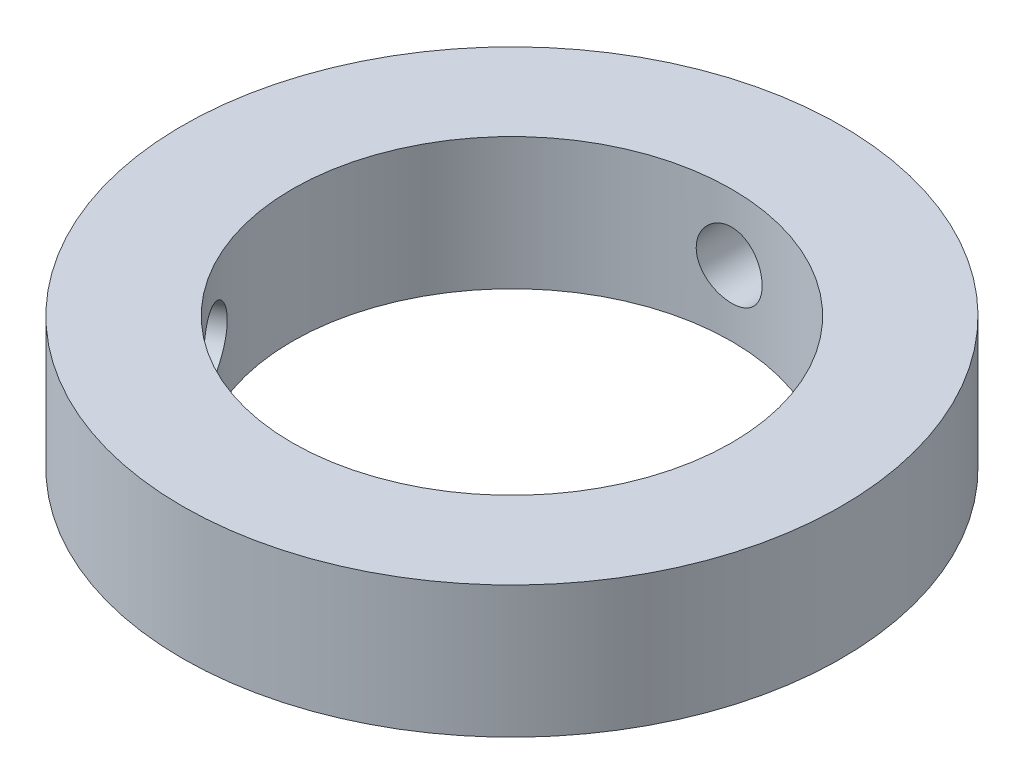
ISO-10303-21;
HEADER;
FILE_DESCRIPTION(('STEP AP214'),'2;1');
FILE_NAME('part.step','',(''),(''),'','','');
FILE_SCHEMA(('AUTOMOTIVE_DESIGN { 1 0 10303 214 1 1 1 1 }'));
ENDSEC;
DATA;
#1=APPLICATION_CONTEXT('core data for automotive mechanical design processes');
#2=APPLICATION_PROTOCOL_DEFINITION('international standard','automotive_design',2000,#1);
#3=PRODUCT_CONTEXT('',#1,'mechanical');
#4=PRODUCT('Part','Part','',(#3));
#5=PRODUCT_RELATED_PRODUCT_CATEGORY('part','',(#4));
#6=PRODUCT_DEFINITION_FORMATION('','',#4);
#7=PRODUCT_DEFINITION_CONTEXT('part definition',#1,'design');
#8=PRODUCT_DEFINITION('design','',#6,#7);
#9=PRODUCT_DEFINITION_SHAPE('','',#8);
#10=(LENGTH_UNIT() NAMED_UNIT(*) SI_UNIT(.MILLI.,.METRE.));
#11=(NAMED_UNIT(*) PLANE_ANGLE_UNIT() SI_UNIT($,.RADIAN.));
#12=(NAMED_UNIT(*) SI_UNIT($,.STERADIAN.) SOLID_ANGLE_UNIT());
#13=UNCERTAINTY_MEASURE_WITH_UNIT(LENGTH_MEASURE(1.E-05),#10,'distance_accuracy_value','');
#14=(GEOMETRIC_REPRESENTATION_CONTEXT(3) GLOBAL_UNCERTAINTY_ASSIGNED_CONTEXT((#13)) GLOBAL_UNIT_ASSIGNED_CONTEXT((#10,
#11,#12)) REPRESENTATION_CONTEXT('',''));
#15=CARTESIAN_POINT('',(0.,0.,0.));
#16=DIRECTION('',(0.,0.,1.));
#17=DIRECTION('',(1.,0.,0.));
#18=AXIS2_PLACEMENT_3D('',#15,#16,#17);
#19=CARTESIAN_POINT('',(0.,6.,0.));
#20=DIRECTION('',(0.,1.,0.));
#21=DIRECTION('',(0.,0.,1.));
#22=AXIS2_PLACEMENT_3D('',#19,#20,#21);
#23=PLANE('',#22);
#24=CARTESIAN_POINT('',(0.,6.,0.));
#25=DIRECTION('',(0.,1.,0.));
#26=DIRECTION('',(0.,0.,1.));
#27=AXIS2_PLACEMENT_3D('',#24,#25,#26);
#28=CIRCLE('',#27,15.);
#29=CARTESIAN_POINT('',(0.,6.,15.));
#30=VERTEX_POINT('',#29);
#31=EDGE_CURVE('E10',#30,#30,#28,.T.);
#32=ORIENTED_EDGE('',*,*,#31,.T.);
#33=EDGE_LOOP('',(#32));
#34=FACE_BOUND('',#33,.T.);
#35=CARTESIAN_POINT('',(0.,6.,0.));
#36=DIRECTION('',(0.,1.,0.));
#37=DIRECTION('',(0.,0.,1.));
#38=AXIS2_PLACEMENT_3D('',#35,#36,#37);
#39=CIRCLE('',#38,10.);
#40=CARTESIAN_POINT('',(0.,6.,10.));
#41=VERTEX_POINT('',#40);
#42=EDGE_CURVE('E42',#41,#41,#39,.T.);
#43=ORIENTED_EDGE('',*,*,#42,.F.);
#44=EDGE_LOOP('',(#43));
#45=FACE_BOUND('',#44,.T.);
#46=ADVANCED_FACE('F31',(#34,#45),#23,.T.);
#47=CARTESIAN_POINT('',(0.,0.,0.));
#48=DIRECTION('',(0.,1.,0.));
#49=DIRECTION('',(0.,0.,1.));
#50=AXIS2_PLACEMENT_3D('',#47,#48,#49);
#51=PLANE('',#50);
#52=CARTESIAN_POINT('',(0.,0.,0.));
#53=DIRECTION('',(0.,1.,0.));
#54=DIRECTION('',(0.,0.,1.));
#55=AXIS2_PLACEMENT_3D('',#52,#53,#54);
#56=CIRCLE('',#55,15.);
#57=CARTESIAN_POINT('',(0.,0.,15.));
#58=VERTEX_POINT('',#57);
#59=EDGE_CURVE('E35',#58,#58,#56,.T.);
#60=ORIENTED_EDGE('',*,*,#59,.F.);
#61=EDGE_LOOP('',(#60));
#62=FACE_BOUND('',#61,.T.);
#63=CARTESIAN_POINT('',(0.,0.,0.));
#64=DIRECTION('',(0.,1.,0.));
#65=DIRECTION('',(0.,0.,1.));
#66=AXIS2_PLACEMENT_3D('',#63,#64,#65);
#67=CIRCLE('',#66,10.);
#68=CARTESIAN_POINT('',(0.,0.,10.));
#69=VERTEX_POINT('',#68);
#70=EDGE_CURVE('E44',#69,#69,#67,.T.);
#71=ORIENTED_EDGE('',*,*,#70,.T.);
#72=EDGE_LOOP('',(#71));
#73=FACE_BOUND('',#72,.T.);
#74=ADVANCED_FACE('F94',(#62,#73),#51,.F.);
#75=CARTESIAN_POINT('',(0.,6.,0.));
#76=DIRECTION('',(0.,-1.,0.));
#77=DIRECTION('',(0.,0.,-1.));
#78=AXIS2_PLACEMENT_3D('',#75,#76,#77);
#79=CYLINDRICAL_SURFACE('',#78,15.);
#80=CARTESIAN_POINT('',(-12.1752659547106,3.,8.76144388397628));
#81=CARTESIAN_POINT('',(-12.1752686280073,3.0840293462604,8.76144122439911));
#82=CARTESIAN_POINT('',(-12.1794295090357,3.16811425261776,8.75566699297302));
#83=CARTESIAN_POINT('',(-12.195913927037,3.3339527794403,8.73269006037868));
#84=CARTESIAN_POINT('',(-12.2082464595789,3.41570372705624,8.71547476452298));
#85=CARTESIAN_POINT('',(-12.2405589633176,3.57444872882686,8.67003395391286));
#86=CARTESIAN_POINT('',(-12.2605342981873,3.65144563408716,8.64181511400248));
#87=CARTESIAN_POINT('',(-12.307324045506,3.79855168843763,8.57504686512413));
#88=CARTESIAN_POINT('',(-12.334137099599,3.86866220172558,8.53649950790416));
#89=CARTESIAN_POINT('',(-12.3936583700528,4.00027689548625,8.44985181271415));
#90=CARTESIAN_POINT('',(-12.4263853681295,4.06175251425568,8.40172098812725));
#91=CARTESIAN_POINT('',(-12.496447051945,4.17410641350536,8.29715394900857));
#92=CARTESIAN_POINT('',(-12.533781948382,4.22498420910947,8.24071735466918));
#93=CARTESIAN_POINT('',(-12.6117954593156,4.31479688551073,8.12082098446708));
#94=CARTESIAN_POINT('',(-12.652480921437,4.3537064981905,8.05734672911471));
#95=CARTESIAN_POINT('',(-12.7357203069752,4.41831664972303,7.9251198636053));
#96=CARTESIAN_POINT('',(-12.7782741848199,4.44401751055421,7.85636738215799));
#97=CARTESIAN_POINT('',(-12.8637112282032,4.48139686402988,7.71567757598853));
#98=CARTESIAN_POINT('',(-12.9065928039217,4.49312224912492,7.64375174628928));
#99=CARTESIAN_POINT('',(-12.9915157638989,4.50236290370058,7.49850609755596));
#100=CARTESIAN_POINT('',(-13.0335571699136,4.49987854161941,7.42518631471422));
#101=CARTESIAN_POINT('',(-13.1154686416279,4.48080829102477,7.27952208695975));
#102=CARTESIAN_POINT('',(-13.1553459298286,4.46427282665417,7.2071750929438));
#103=CARTESIAN_POINT('',(-13.2320820705779,4.41764830658007,7.06530344178578));
#104=CARTESIAN_POINT('',(-13.2689408839103,4.38755907481865,6.99577882131799));
#105=CARTESIAN_POINT('',(-13.3388726674995,4.31462585511834,6.86150294871651));
#106=CARTESIAN_POINT('',(-13.3719388734042,4.27175955370477,6.79676029653133));
#107=CARTESIAN_POINT('',(-13.4335588666886,4.17450521499545,6.67414505201013));
#108=CARTESIAN_POINT('',(-13.4621125216821,4.12011683978223,6.6162726612417));
#109=CARTESIAN_POINT('',(-13.5143312366497,4.00107865572953,6.50895047184306));
#110=CARTESIAN_POINT('',(-13.5379743565742,3.93638498288764,6.45953864003969));
#111=CARTESIAN_POINT('',(-13.5798559484302,3.79872470218384,6.37102173569905));
#112=CARTESIAN_POINT('',(-13.598094412522,3.72575808232179,6.33191667811231));
#113=CARTESIAN_POINT('',(-13.6289246329048,3.57358946220032,6.26528276870627));
#114=CARTESIAN_POINT('',(-13.6415151986067,3.49438615136567,6.23775635776673));
#115=CARTESIAN_POINT('',(-13.6608883219285,3.33200909307797,6.19521440602366));
#116=CARTESIAN_POINT('',(-13.6676710564938,3.24883546666883,6.18019848406723));
#117=CARTESIAN_POINT('',(-13.6753334089643,3.08126373070574,6.16322514105224));
#118=CARTESIAN_POINT('',(-13.676238421192,2.99687246960275,6.16121154449792));
#119=CARTESIAN_POINT('',(-13.6722026478534,2.8289231012657,6.17016190318325));
#120=CARTESIAN_POINT('',(-13.6672619412756,2.74536498278945,6.18112568307007));
#121=CARTESIAN_POINT('',(-13.6516080148652,2.58163262658249,6.21562164591093));
#122=CARTESIAN_POINT('',(-13.640906954067,2.50145164335801,6.23912735427677));
#123=CARTESIAN_POINT('',(-13.6138675551842,2.34653992240454,6.29790843807133));
#124=CARTESIAN_POINT('',(-13.5975290879693,2.27180930956922,6.33318408310158));
#125=CARTESIAN_POINT('',(-13.5593599683941,2.12964003895683,6.41449714729722));
#126=CARTESIAN_POINT('',(-13.5375107974431,2.06222708705062,6.46057081525648));
#127=CARTESIAN_POINT('',(-13.4886633299504,1.9368674200889,6.5619447650902));
#128=CARTESIAN_POINT('',(-13.461664905913,1.87892093948988,6.61724527541769));
#129=CARTESIAN_POINT('',(-13.4028565662955,1.77392754990286,6.73556289609712));
#130=CARTESIAN_POINT('',(-13.3710296668994,1.72692066062067,6.79860708908372));
#131=CARTESIAN_POINT('',(-13.3032430047234,1.64541619724038,6.93031047358269));
#132=CARTESIAN_POINT('',(-13.267283298581,1.61091845173934,6.99896958814241));
#133=CARTESIAN_POINT('',(-13.1920843958636,1.55547934851699,7.13969588104783));
#134=CARTESIAN_POINT('',(-13.1528511889519,1.53451381901218,7.21175673451208));
#135=CARTESIAN_POINT('',(-13.0720189272504,1.50665539563023,7.35725789890982));
#136=CARTESIAN_POINT('',(-13.0304199389853,1.49976210624894,7.43069817101583));
#137=CARTESIAN_POINT('',(-12.946182802766,1.50024939965991,7.57650377093299));
#138=CARTESIAN_POINT('',(-12.9035499787105,1.50756785525498,7.64887239016927));
#139=CARTESIAN_POINT('',(-12.8183363511877,1.53614061848546,7.7908349785635));
#140=CARTESIAN_POINT('',(-12.7757555477614,1.55739493705945,7.86042894554351));
#141=CARTESIAN_POINT('',(-12.6920055400196,1.6132188860894,7.99495326915927));
#142=CARTESIAN_POINT('',(-12.6508361440025,1.64778670040123,8.05988426045633));
#143=CARTESIAN_POINT('',(-12.5712857902903,1.72924975337547,8.18340866723737));
#144=CARTESIAN_POINT('',(-12.5329048162809,1.77614491990668,8.24200211980145));
#145=CARTESIAN_POINT('',(-12.4601293337544,1.88116442853562,8.35161846512974));
#146=CARTESIAN_POINT('',(-12.4257522129968,1.9393350243672,8.40260858864906));
#147=CARTESIAN_POINT('',(-12.3624389609383,2.06516302731817,8.49548533727556));
#148=CARTESIAN_POINT('',(-12.333504137358,2.13282270775361,8.53736977476826));
#149=CARTESIAN_POINT('',(-12.2821386285056,2.27589651287987,8.61110337214203));
#150=CARTESIAN_POINT('',(-12.2597246725362,2.35132992198608,8.64292673812074));
#151=CARTESIAN_POINT('',(-12.2224231966915,2.50762243686935,8.69559787459574));
#152=CARTESIAN_POINT('',(-12.2075271880073,2.58847530588857,8.71645802519363));
#153=CARTESIAN_POINT('',(-12.1895865403145,2.72482161134867,8.74151701506189));
#154=CARTESIAN_POINT('',(-12.1842263230693,2.77944337695964,8.74898091559667));
#155=CARTESIAN_POINT('',(-12.1770651576448,2.88936873456383,8.75894521521235));
#156=CARTESIAN_POINT('',(-12.1752641945244,2.94467232369389,8.76144563512908));
#157=CARTESIAN_POINT('',(-12.1752659547106,3.,8.76144388397628));
#158=B_SPLINE_CURVE_WITH_KNOTS('',3,(#80,#81,#82,#83,#84,#85,#86,#87,#88,#89,#90,#91,#92,#93,
#94,#95,#96,#97,#98,#99,#100,#101,#102,#103,#104,#105,#106,#107,#108,#109,#110,#111,#112,#113,
#114,#115,#116,#117,#118,#119,#120,#121,#122,#123,#124,#125,#126,#127,#128,#129,#130,#131,#132,
#133,#134,#135,#136,#137,#138,#139,#140,#141,#142,#143,#144,#145,#146,#147,#148,#149,#150,#151,
#152,#153,#154,#155,#156,#157),.UNSPECIFIED.,.T.,.F.,(4,2,2,2,2,2,2,2,2,2,2,2,2,2,2,2,2,2,2,2,2,
2,2,2,2,2,2,2,2,2,2,2,2,2,2,2,2,2,4),(0.,0.251885991654694,0.504049727732656,0.756060736496213,
1.00802172063197,1.26079742294888,1.5135846878288,1.76690204956938,2.02021323611693,
2.27267206347675,2.52512434497349,2.77667447727993,3.02822787721462,3.28022318199621,
3.53222587827794,3.78533137627503,4.03843724141345,4.29159643676902,4.54474791892551,
4.79680494461649,5.04885856450307,5.30038222056792,5.55191163841573,5.80429784717579,
6.05669030584806,6.30999205227179,6.56329032777009,6.81613489041544,7.06897234669726,
7.32070700202727,7.5724418549499,7.82414237992872,8.07584143216201,8.32859572556985,
8.5814106755179,8.83486861605717,9.08803972341004,9.25389041409072,9.41974040855725),.UNSPECIFIED.);
#159=CARTESIAN_POINT('',(-12.1752659547106,3.,8.76144388397628));
#160=VERTEX_POINT('',#159);
#161=EDGE_CURVE('E76',#160,#160,#158,.T.);
#162=ORIENTED_EDGE('',*,*,#161,.F.);
#163=EDGE_LOOP('',(#162));
#164=FACE_BOUND('',#163,.T.);
#165=CARTESIAN_POINT('',(-1.5,3.,-14.9248115565993));
#166=CARTESIAN_POINT('',(-1.49999636009027,3.0840293462604,-14.9248125419535));
#167=CARTESIAN_POINT('',(-1.49291528847371,3.16811425261776,-14.9255288549133));
#168=CARTESIAN_POINT('',(-1.46477447214534,3.3339527794403,-14.9283163133718));
#169=CARTESIAN_POINT('',(-1.44369932232965,3.41570372705623,-14.9303889519183));
#170=CARTESIAN_POINT('',(-1.38819017410339,3.57444872882686,-14.9356519957108));
#171=CARTESIAN_POINT('',(-1.35376427444085,3.65144563408716,-14.9388417232018));
#172=CARTESIAN_POINT('',(-1.27254640108665,3.79855168843762,-14.9459787085773));
#173=CARTESIAN_POINT('',(-1.22575688343889,3.86866220172558,-14.9499258159649));
#174=CARTESIAN_POINT('',(-1.12095714299806,4.00027689548625,-14.9581489006485));
#175=CARTESIAN_POINT('',(-1.06291112716239,4.06175251425567,-14.962425900079));
#176=CARTESIAN_POINT('',(-0.937322572979346,4.17410641350535,-14.9708175785358));
#177=CARTESIAN_POINT('',(-0.869779600359852,4.22498420910947,-14.9749322501282));
#178=CARTESIAN_POINT('',(-0.72693954247648,4.31479688551073,-14.9825457473341));
#179=CARTESIAN_POINT('',(-0.651626493794353,4.3537064981905,-14.9860432634197));
#180=CARTESIAN_POINT('',(-0.495494976431265,4.41831664972302,-14.9920172531366));
#181=CARTESIAN_POINT('',(-0.414676642002328,4.4440175105542,-14.994493751656));
#182=CARTESIAN_POINT('',(-0.250117174114424,4.48139686402987,-14.9981394985654));
#183=CARTESIAN_POINT('',(-0.166386790547372,4.49312224912492,-14.9993131176423));
#184=CARTESIAN_POINT('',(0.00186111103341518,4.50236290370058,-15.0002357339804));
#185=CARTESIAN_POINT('',(0.0863786085816924,4.49987854161941,-14.9999847681791));
#186=CARTESIAN_POINT('',(0.253483266096841,4.48080829102477,-14.9980900696678));
#187=CARTESIAN_POINT('',(0.336076244902469,4.46427282665416,-14.9964513172757));
#188=CARTESIAN_POINT('',(0.4973087692568,4.41764830658007,-14.991970938974));
#189=CARTESIAN_POINT('',(0.575948263436593,4.38755907481864,-14.9891292974393));
#190=CARTESIAN_POINT('',(0.72720047201938,4.31462585511834,-14.9825540622587));
#191=CARTESIAN_POINT('',(0.799802356472475,4.27175955370476,-14.9788189104864));
#192=CARTESIAN_POINT('',(0.936800269761291,4.17450521499545,-14.9708757677911));
#193=CARTESIAN_POINT('',(1.00119605784124,4.12011683978223,-14.9666677630022));
#194=CARTESIAN_POINT('',(1.12024915773403,4.00107865572953,-14.9582294020178));
#195=CARTESIAN_POINT('',(1.17486261928552,3.93638498288764,-14.9539990285954));
#196=CARTESIAN_POINT('',(1.27246130303688,3.79872470218383,-14.9460110989233));
#197=CARTESIAN_POINT('',(1.31544650836933,3.72575808232179,-14.9422535433595));
#198=CARTESIAN_POINT('',(1.38856827685985,3.57358946220031,-14.9356363427122));
#199=CARTESIAN_POINT('',(1.41870213085944,3.49438615136567,-14.9327768869883));
#200=CARTESIAN_POINT('',(1.46523110345638,3.33200909307797,-14.9282835280641));
#201=CARTESIAN_POINT('',(1.48162664061455,3.24883546666883,-14.9266495875265));
#202=CARTESIAN_POINT('',(1.50015716308794,3.08126373070574,-14.9247987079113));
#203=CARTESIAN_POINT('',(1.50235349497082,2.99687246960275,-14.924575673214));
#204=CARTESIAN_POINT('',(1.49258437030704,2.82892310126571,-14.9255557703216));
#205=CARTESIAN_POINT('',(1.48061910511463,2.74536498278945,-14.9267588828559));
#206=CARTESIAN_POINT('',(1.44291776176128,2.58163262658249,-14.930450166336));
#207=CARTESIAN_POINT('',(1.41721069078336,2.50145164335801,-14.9329356300202));
#208=CARTESIAN_POINT('',(1.35278507951391,2.34653992240454,-14.9389093655819));
#209=CARTESIAN_POINT('',(1.31406624117538,2.27180930956923,-14.94239766043));
#210=CARTESIAN_POINT('',(1.22456250213483,2.12964003895684,-14.9499987653357));
#211=CARTESIAN_POINT('',(1.17373694976104,2.06222708705062,-14.9541136622201));
#212=CARTESIAN_POINT('',(1.06152080017676,1.9368674200889,-14.9624974893778));
#213=CARTESIAN_POINT('',(1.0001299413722,1.87892093948989,-14.966766423463));
#214=CARTESIAN_POINT('',(0.868259706339711,1.77392754990286,-14.9749957177395));
#215=CARTESIAN_POINT('',(0.797748383954178,1.72692066062067,-14.9789549108321));
#216=CARTESIAN_POINT('',(0.649796576125697,1.64541619724038,-14.9861016315995));
#217=CARTESIAN_POINT('',(0.572356185644438,1.61091845173934,-14.9892891698474));
#218=CARTESIAN_POINT('',(0.412884189649223,1.555479348517,-14.9945281562101));
#219=CARTESIAN_POINT('',(0.33086105647494,1.53451381901218,-14.9965816290847));
#220=CARTESIAN_POINT('',(0.164437220975519,1.50665539563023,-14.9993294192047));
#221=CARTESIAN_POINT('',(0.080036585538327,1.49976210624894,-15.0000237746484));
#222=CARTESIAN_POINT('',(-0.0883533361136192,1.50024939965991,-14.999975074699));
#223=CARTESIAN_POINT('',(-0.172342810836791,1.50756785525499,-14.99923827565));
#224=CARTESIAN_POINT('',(-0.337892832534544,1.53614061848546,-14.9964224036639));
#225=CARTESIAN_POINT('',(-0.419453377602548,1.55739493705945,-14.9943433296731));
#226=CARTESIAN_POINT('',(-0.577829863151615,1.6132188860894,-14.9890758572094));
#227=CARTESIAN_POINT('',(-0.654646449116293,1.64778670040124,-14.9858876100487));
#228=CARTESIAN_POINT('',(-0.801396900232194,1.72924975337547,-14.9787571862444));
#229=CARTESIAN_POINT('',(-0.871330805652838,1.77614491990668,-14.9748150140123));
#230=CARTESIAN_POINT('',(-1.00264908664041,1.88116442853563,-14.9665977700358));
#231=CARTESIAN_POINT('',(-1.06399638932901,1.9393350243672,-14.9623213719105));
#232=CARTESIAN_POINT('',(-1.17608663908971,2.06516302731817,-14.9539288615449));
#233=CARTESIAN_POINT('',(-1.22682703777177,2.13282270775362,-14.9498127880167));
#234=CARTESIAN_POINT('',(-1.31636496063608,2.27589651287987,-14.942195751159));
#235=CARTESIAN_POINT('',(-1.35513178199225,2.35132992198608,-14.9386963788796));
#236=CARTESIAN_POINT('',(-1.41939706214815,2.50762243686935,-14.9327279214369));
#237=CARTESIAN_POINT('',(-1.44491048683479,2.58847530588857,-14.9302576748004));
#238=CARTESIAN_POINT('',(-1.47558253250029,2.72482161134867,-14.9272501130722));
#239=CARTESIAN_POINT('',(-1.48472656859734,2.77944337695964,-14.9263399790354));
#240=CARTESIAN_POINT('',(-1.49693648790767,2.88936873456383,-14.9251203776649));
#241=CARTESIAN_POINT('',(-1.5000023966359,2.94467232369389,-14.9248109078098));
#242=CARTESIAN_POINT('',(-1.5,3.,-14.9248115565993));
#243=B_SPLINE_CURVE_WITH_KNOTS('',3,(#165,#166,#167,#168,#169,#170,#171,#172,#173,#174,#175,
#176,#177,#178,#179,#180,#181,#182,#183,#184,#185,#186,#187,#188,#189,#190,#191,#192,#193,#194,
#195,#196,#197,#198,#199,#200,#201,#202,#203,#204,#205,#206,#207,#208,#209,#210,#211,#212,#213,
#214,#215,#216,#217,#218,#219,#220,#221,#222,#223,#224,#225,#226,#227,#228,#229,#230,#231,#232,
#233,#234,#235,#236,#237,#238,#239,#240,#241,#242),.UNSPECIFIED.,.T.,.F.,(4,2,2,2,2,2,2,2,2,2,2,
2,2,2,2,2,2,2,2,2,2,2,2,2,2,2,2,2,2,2,2,2,2,2,2,2,2,2,4),(0.,0.251885991654692,
0.504049727732655,0.756060736496211,1.00802172063197,1.26079742294888,1.51358468782879,
1.76690204956938,2.02021323611692,2.27267206347674,2.52512434497349,2.77667447727992,
3.02822787721461,3.2802231819962,3.53222587827793,3.78533137627502,4.03843724141344,
4.291596436769,4.54474791892549,4.79680494461648,5.04885856450305,5.30038222056791,
5.55191163841571,5.80429784717577,6.05669030584804,6.30999205227177,6.56329032777007,
6.81613489041542,7.06897234669724,7.32070700202724,7.57244185494987,7.82414237992869,
8.07584143216198,8.32859572556982,8.58141067551787,8.83486861605715,9.08803972341001,
9.2538904140907,9.41974040855723),.UNSPECIFIED.);
#244=CARTESIAN_POINT('',(-1.5,3.,-14.9248115565993));
#245=VERTEX_POINT('',#244);
#246=EDGE_CURVE('E56',#245,#245,#243,.T.);
#247=ORIENTED_EDGE('',*,*,#246,.F.);
#248=EDGE_LOOP('',(#247));
#249=FACE_BOUND('',#248,.T.);
#250=ORIENTED_EDGE('',*,*,#31,.F.);
#251=EDGE_LOOP('',(#250));
#252=FACE_BOUND('',#251,.T.);
#253=ORIENTED_EDGE('',*,*,#59,.T.);
#254=EDGE_LOOP('',(#253));
#255=FACE_BOUND('',#254,.T.);
#256=ADVANCED_FACE('F33',(#164,#249,#252,#255),#79,.T.);
#257=CARTESIAN_POINT('',(0.,6.,0.));
#258=DIRECTION('',(0.,-1.,0.));
#259=DIRECTION('',(0.,0.,-1.));
#260=AXIS2_PLACEMENT_3D('',#257,#258,#259);
#261=CYLINDRICAL_SURFACE('',#260,10.);
#262=CARTESIAN_POINT('',(-7.81227189477187,3.,6.24246808899794));
#263=CARTESIAN_POINT('',(-7.81227483670854,3.08374556928995,6.24246579350082));
#264=CARTESIAN_POINT('',(-7.8167218671006,3.16753975075071,6.23691161232913));
#265=CARTESIAN_POINT('',(-7.83431030002112,3.33278531488313,6.21480281416805));
#266=CARTESIAN_POINT('',(-7.84746018292153,3.41423433148001,6.19823746743476));
#267=CARTESIAN_POINT('',(-7.8818230173325,3.5723737554469,6.15448085743884));
#268=CARTESIAN_POINT('',(-7.90302978059303,3.64906776254216,6.12729774891369));
#269=CARTESIAN_POINT('',(-7.95254263433635,3.79562703077208,6.06289599023471));
#270=CARTESIAN_POINT('',(-7.98084774742056,3.8654932302143,6.02567872166933));
#271=CARTESIAN_POINT('',(-8.04356690468586,3.99698381675433,5.94169923196536));
#272=CARTESIAN_POINT('',(-8.07802323609122,4.05854561340674,5.89487057952921));
#273=CARTESIAN_POINT('',(-8.15148642122049,4.1711374856555,5.79285872461926));
#274=CARTESIAN_POINT('',(-8.19049352496962,4.22216698216699,5.73767506306101));
#275=CARTESIAN_POINT('',(-8.27173053418005,4.31247663169136,5.61992939684502));
#276=CARTESIAN_POINT('',(-8.31397502474992,4.35169915032246,5.55733321298581));
#277=CARTESIAN_POINT('',(-8.3999432138492,4.41691159880818,5.42651570784787));
#278=CARTESIAN_POINT('',(-8.44366683409039,4.4429022278429,5.35829468401009));
#279=CARTESIAN_POINT('',(-8.53073492500932,4.48072338853084,5.21855197993721));
#280=CARTESIAN_POINT('',(-8.57407977849882,4.49265872638717,5.14705891323802));
#281=CARTESIAN_POINT('',(-8.65934166449277,4.5023559348249,5.00228517239217));
#282=CARTESIAN_POINT('',(-8.70125877624058,4.50011859331969,4.92900459784552));
#283=CARTESIAN_POINT('',(-8.78215265427367,4.48161666223758,4.78337539618804));
#284=CARTESIAN_POINT('',(-8.82115032424321,4.46546482820852,4.71102401025766));
#285=CARTESIAN_POINT('',(-8.89564898602176,4.41976939367743,4.56879399446875));
#286=CARTESIAN_POINT('',(-8.93114988780476,4.39022544849857,4.49891542830384));
#287=CARTESIAN_POINT('',(-8.99809807485158,4.31846900308291,4.36348084033346));
#288=CARTESIAN_POINT('',(-9.02952952916854,4.27620903489127,4.29794215734937));
#289=CARTESIAN_POINT('',(-9.08772073284921,4.18025480633002,4.17349473061652));
#290=CARTESIAN_POINT('',(-9.1144801744848,4.12655979329314,4.11458642367676));
#291=CARTESIAN_POINT('',(-9.16328907415942,4.00863155117341,4.00472092296763));
#292=CARTESIAN_POINT('',(-9.18528962419408,3.94429987802989,3.95384762112573));
#293=CARTESIAN_POINT('',(-9.22409541078835,3.80725892287627,3.8624521837221));
#294=CARTESIAN_POINT('',(-9.24090061535487,3.73454958928008,3.82193011190383));
#295=CARTESIAN_POINT('',(-9.26926464882218,3.58271603705936,3.752618185175));
#296=CARTESIAN_POINT('',(-9.2808193814142,3.50358686633762,3.72383749242646));
#297=CARTESIAN_POINT('',(-9.29864353490383,3.34121474485261,3.67910501405588));
#298=CARTESIAN_POINT('',(-9.30491332829329,3.25797208445325,3.66315232429717));
#299=CARTESIAN_POINT('',(-9.31213139481333,3.09059991042251,3.6447643253266));
#300=CARTESIAN_POINT('',(-9.31313065566064,3.00648681179847,3.64219950291999));
#301=CARTESIAN_POINT('',(-9.3099451977831,2.83900580518266,3.65033406050084));
#302=CARTESIAN_POINT('',(-9.30576063991193,2.75563787414923,3.66103302891342));
#303=CARTESIAN_POINT('',(-9.29224235654617,2.59244018203437,3.69520817144752));
#304=CARTESIAN_POINT('',(-9.28293451844717,2.5125947950584,3.71862010037172));
#305=CARTESIAN_POINT('',(-9.25919654818808,2.35821590795139,3.77733717778722));
#306=CARTESIAN_POINT('',(-9.24476616305811,2.2836826703718,3.81264291363328));
#307=CARTESIAN_POINT('',(-9.210693032647,2.14142673966496,3.89423880827598));
#308=CARTESIAN_POINT('',(-9.1910118585995,2.07375955272018,3.94060967353736));
#309=CARTESIAN_POINT('',(-9.14659104204616,1.94772714012619,4.04264278778879));
#310=CARTESIAN_POINT('',(-9.12185111349277,1.88936244081885,4.09830556215762));
#311=CARTESIAN_POINT('',(-9.06730009240182,1.78309739336641,4.21762965683378));
#312=CARTESIAN_POINT('',(-9.03744847022963,1.73528827175752,4.28135374798511));
#313=CARTESIAN_POINT('',(-8.97321088248898,1.65212709473736,4.41440094513943));
#314=CARTESIAN_POINT('',(-8.93882504100308,1.61677469853497,4.48372389790496));
#315=CARTESIAN_POINT('',(-8.86626702704458,1.55967625751197,4.62554042890202));
#316=CARTESIAN_POINT('',(-8.82810934086875,1.53788033292164,4.6980213211999));
#317=CARTESIAN_POINT('',(-8.74876305142902,1.50835212046252,4.84417742468154));
#318=CARTESIAN_POINT('',(-8.70757464853116,1.50061890375085,4.91785255666134));
#319=CARTESIAN_POINT('',(-8.62369214213125,1.49945829545059,5.06348964217903));
#320=CARTESIAN_POINT('',(-8.581016771534,1.50589131912302,5.13546131157838));
#321=CARTESIAN_POINT('',(-8.49506920422535,1.53258138842075,5.27642073485081));
#322=CARTESIAN_POINT('',(-8.45179700942426,1.55283838980856,5.34540849827181));
#323=CARTESIAN_POINT('',(-8.36611875104762,1.60655187557023,5.47853299588011));
#324=CARTESIAN_POINT('',(-8.32371207714006,1.63999869513893,5.54267324115768));
#325=CARTESIAN_POINT('',(-8.24123032848331,1.71912748798314,5.66458704409934));
#326=CARTESIAN_POINT('',(-8.20115532948233,1.76480985848034,5.7223603949791));
#327=CARTESIAN_POINT('',(-8.12447869184737,1.86761769882917,5.8307203334332));
#328=CARTESIAN_POINT('',(-8.08791305565085,1.92484622581634,5.88123462893191));
#329=CARTESIAN_POINT('',(-8.02014875093807,2.04890507308047,5.97331491289522));
#330=CARTESIAN_POINT('',(-7.98895134410739,2.11573764382434,6.01487879833614));
#331=CARTESIAN_POINT('',(-7.93310454199684,2.25754898323253,6.08834955208838));
#332=CARTESIAN_POINT('',(-7.9084929266312,2.33257141702183,6.12020084291539));
#333=CARTESIAN_POINT('',(-7.86719077564671,2.4882967767633,6.17320404595717));
#334=CARTESIAN_POINT('',(-7.85049202063262,2.56899370785782,6.19436706200888));
#335=CARTESIAN_POINT('',(-7.82957805389605,2.70837743625647,6.22076271932229));
#336=CARTESIAN_POINT('',(-7.82310324026869,2.76620339692427,6.22889270264552));
#337=CARTESIAN_POINT('',(-7.81444915797363,2.88267829173435,6.23974615656608));
#338=CARTESIAN_POINT('',(-7.81226983362859,2.94132721519961,6.24246969724074));
#339=CARTESIAN_POINT('',(-7.81227189477187,3.,6.24246808899794));
#340=B_SPLINE_CURVE_WITH_KNOTS('',3,(#262,#263,#264,#265,#266,#267,#268,#269,#270,#271,#272,
#273,#274,#275,#276,#277,#278,#279,#280,#281,#282,#283,#284,#285,#286,#287,#288,#289,#290,#291,
#292,#293,#294,#295,#296,#297,#298,#299,#300,#301,#302,#303,#304,#305,#306,#307,#308,#309,#310,
#311,#312,#313,#314,#315,#316,#317,#318,#319,#320,#321,#322,#323,#324,#325,#326,#327,#328,#329,
#330,#331,#332,#333,#334,#335,#336,#337,#338,#339),.UNSPECIFIED.,.T.,.F.,(4,2,2,2,2,2,2,2,2,2,2,
2,2,2,2,2,2,2,2,2,2,2,2,2,2,2,2,2,2,2,2,2,2,2,2,2,2,2,4),(0.,0.251022251804868,
0.502289469561803,0.753364085335675,1.00440414866133,1.25724158649108,1.51009292207817,
1.76415922105783,2.01821209364501,2.27035832534397,2.52249053939374,2.77259862515728,
3.02271314839402,3.27377316386454,3.52484970949273,3.7783954466627,4.03194274514351,
4.2856875177314,4.53941440444342,4.79068214603745,5.04194209099919,5.29194394807375,
5.54195815286118,5.79385486001304,6.04576581461803,6.29977537753517,6.55377799071856,
6.80684040891091,7.05988611170475,7.31044963622328,7.56101235892825,7.81139182257835,
8.06177941567108,8.31450950010971,8.56729890236864,8.82150878824933,9.07545403445566,
9.25132441891615,9.42719252376195),.UNSPECIFIED.);
#341=CARTESIAN_POINT('',(-7.81227189477187,3.,6.24246808899794));
#342=VERTEX_POINT('',#341);
#343=EDGE_CURVE('E79',#342,#342,#340,.T.);
#344=ORIENTED_EDGE('',*,*,#343,.T.);
#345=EDGE_LOOP('',(#344));
#346=FACE_BOUND('',#345,.T.);
#347=CARTESIAN_POINT('',(-1.5,3.,-9.88685996664259));
#348=CARTESIAN_POINT('',(-1.49999654107284,3.08374556928995,-9.88686136668593));
#349=CARTESIAN_POINT('',(-1.49296296388491,3.16753975075071,-9.88793551739101));
#350=CARTESIAN_POINT('',(-1.46502196657001,3.33278531488313,-9.8921131480324));
#351=CARTESIAN_POINT('',(-1.44410101402628,3.41423433148001,-9.8952186073143));
#352=CARTESIAN_POINT('',(-1.38902526098084,3.5723737554469,-9.90309938986228));
#353=CARTESIAN_POINT('',(-1.35488061681397,3.64906776254216,-9.90787343131536));
#354=CARTESIAN_POINT('',(-1.27435063087791,3.79562703077208,-9.91855194113145));
#355=CARTESIAN_POINT('',(-1.22796697429872,3.8654932302143,-9.92445625383668));
#356=CARTESIAN_POINT('',(-1.12387902418558,3.99698381675433,-9.9367828924804));
#357=CARTESIAN_POINT('',(-1.0660960558482,4.05854561340674,-9.94320862458057));
#358=CARTESIAN_POINT('',(-0.941019605444374,4.1711374856555,-9.95582368169047));
#359=CARTESIAN_POINT('',(-0.87372560078653,4.22216698216699,-9.96201299368615));
#360=CARTESIAN_POINT('',(-0.731136358052746,4.31247663169136,-9.97349347428185));
#361=CARTESIAN_POINT('',(-0.655804227365768,4.35169915032246,-9.97878018435569));
#362=CARTESIAN_POINT('',(-0.499528850106975,4.41691159880818,-9.98782206746405));
#363=CARTESIAN_POINT('',(-0.418585900270678,4.44290222784289,-9.99157732141945));
#364=CARTESIAN_POINT('',(-0.25403112309057,4.48072338853084,-9.99710914797782));
#365=CARTESIAN_POINT('',(-0.170443884389867,4.49265872638717,-9.99890035887344));
#366=CARTESIAN_POINT('',(-0.00243520401947976,4.5023559348249,-10.0003524476958));
#367=CARTESIAN_POINT('',(0.0819861910157455,4.50011859331969,-10.0000134440494));
#368=CARTESIAN_POINT('',(0.248551718200519,4.48161666223757,-9.99725499660796));
#369=CARTESIAN_POINT('',(0.330708691400007,4.46546482820852,-9.99485227652479));
#370=CARTESIAN_POINT('',(0.491132829143137,4.41976939367743,-9.98825500227851));
#371=CARTESIAN_POINT('',(0.569399893513481,4.39022544849856,-9.98406040199739));
#372=CARTESIAN_POINT('',(0.720163780770316,4.31846900308291,-9.97432193873206));
#373=CARTESIAN_POINT('',(0.792637672323596,4.27620903489126,-9.96877303515638));
#374=CARTESIAN_POINT('',(0.929507907150177,4.18025480633002,-9.95694438245421));
#375=CARTESIAN_POINT('',(0.993903718271735,4.12655979329314,-9.95066458523184));
#376=CARTESIAN_POINT('',(1.11345448272265,4.00863155117341,-9.93800158192627));
#377=CARTESIAN_POINT('',(1.16851232950947,3.94429987802989,-9.93161796623257));
#378=CARTESIAN_POINT('',(1.26706599338813,3.80725892287627,-9.91952704453523));
#379=CARTESIAN_POINT('',(1.31056173927999,3.73454958928008,-9.91381974269649));
#380=CARTESIAN_POINT('',(1.38476964534605,3.58271603705936,-9.90372775286855));
#381=CARTESIAN_POINT('',(1.41547182270082,3.50358686633761,-9.89934409845291));
#382=CARTESIAN_POINT('',(1.46312336208879,3.34121474485261,-9.89241402899059));
#383=CARTESIAN_POINT('',(1.48007369337326,3.25797208445325,-9.88986748446299));
#384=CARTESIAN_POINT('',(1.49960720086655,3.09059991042251,-9.88692451395027));
#385=CARTESIAN_POINT('',(1.50232803265052,3.00648681179847,-9.88650748802574));
#386=CARTESIAN_POINT('',(1.49369057019819,2.83900580518266,-9.88781607937153));
#387=CARTESIAN_POINT('',(1.48233271282302,2.75563787414924,-9.88954163015778));
#388=CARTESIAN_POINT('',(1.44597702952766,2.59244018203437,-9.89492202461453));
#389=CARTESIAN_POINT('',(1.42104778527821,2.5125947950584,-9.89856716482858));
#390=CARTESIAN_POINT('',(1.35832831947087,2.35821590795139,-9.90736801825768));
#391=CARTESIAN_POINT('',(1.32053746276389,2.2836826703718,-9.91252380607176));
#392=CARTESIAN_POINT('',(1.23283677995324,2.14142673966496,-9.92381355687063));
#393=CARTESIAN_POINT('',(1.18283784561766,2.07375955272018,-9.92995459279988));
#394=CARTESIAN_POINT('',(1.07226416837201,1.94772714012619,-9.94250159433355));
#395=CARTESIAN_POINT('',(1.0116888274468,1.88936244081885,-9.94890757490292));
#396=CARTESIAN_POINT('',(0.881075619628184,1.78309739336642,-9.96132705217386));
#397=CARTESIAN_POINT('',(0.810963126771958,1.73528827175752,-9.96733683460423));
#398=CARTESIAN_POINT('',(0.663622080263681,1.65212709473736,-9.97822905032016));
#399=CARTESIAN_POINT('',(0.586393721360439,1.61677469853497,-9.98311151444563));
#400=CARTESIAN_POINT('',(0.427297995861147,1.55967625751197,-9.99118269660795));
#401=CARTESIAN_POINT('',(0.345448858754303,1.53788033292164,-9.99437761717899));
#402=CARTESIAN_POINT('',(0.179200815501194,1.50835212046253,-9.99873976656896));
#403=CARTESIAN_POINT('',(0.0948020781305819,1.50061890375086,-9.99990712930801));
#404=CARTESIAN_POINT('',(-0.0732645908608175,1.4994582954506,-10.0000812905914));
#405=CARTESIAN_POINT('',(-0.156931570212051,1.50589131912302,-9.99910917023796));
#406=CARTESIAN_POINT('',(-0.321979795323106,1.53258138842076,-9.99515610519141));
#407=CARTESIAN_POINT('',(-0.403361048396512,1.55283838980856,-9.99217516692666));
#408=CARTESIAN_POINT('',(-0.56148937437966,1.60655187557024,-9.98453786742463));
#409=CARTESIAN_POINT('',(-0.638239793148782,1.63999869513893,-9.97988273316947));
#410=CARTESIAN_POINT('',(-0.785061117896602,1.71912748798314,-9.96940834495499));
#411=CARTESIAN_POINT('',(-0.855131806920708,1.76480985848034,-9.96358905320338));
#412=CARTESIAN_POINT('',(-0.987312585191958,1.86761769882917,-9.95136510636178));
#413=CARTESIAN_POINT('',(-1.04934206644638,1.92484622581634,-9.94495548425942));
#414=CARTESIAN_POINT('',(-1.16296808390268,2.04890507308047,-9.93231001689001));
#415=CARTESIAN_POINT('',(-1.21456216798984,2.11573764382434,-9.92607421276291));
#416=CARTESIAN_POINT('',(-1.30611310822974,2.25754898323253,-9.91444484029116));
#417=CARTESIAN_POINT('',(-1.34600294291209,2.33257141702183,-9.90905620156985));
#418=CARTESIAN_POINT('',(-1.41255613872045,2.4882967767633,-9.89978909110724));
#419=CARTESIAN_POINT('',(-1.43923322574897,2.56899370785782,-9.89590905307931));
#420=CARTESIAN_POINT('',(-1.47254951890026,2.70837743625648,-9.89099485524825));
#421=CARTESIAN_POINT('',(-1.4828276978042,2.76620339692427,-9.88945249382379));
#422=CARTESIAN_POINT('',(-1.49655410576574,2.88267829173435,-9.88738456567011));
#423=CARTESIAN_POINT('',(-1.50000242335076,2.94132721519961,-9.88685898576155));
#424=CARTESIAN_POINT('',(-1.5,3.,-9.88685996664259));
#425=B_SPLINE_CURVE_WITH_KNOTS('',3,(#347,#348,#349,#350,#351,#352,#353,#354,#355,#356,#357,
#358,#359,#360,#361,#362,#363,#364,#365,#366,#367,#368,#369,#370,#371,#372,#373,#374,#375,#376,
#377,#378,#379,#380,#381,#382,#383,#384,#385,#386,#387,#388,#389,#390,#391,#392,#393,#394,#395,
#396,#397,#398,#399,#400,#401,#402,#403,#404,#405,#406,#407,#408,#409,#410,#411,#412,#413,#414,
#415,#416,#417,#418,#419,#420,#421,#422,#423,#424),.UNSPECIFIED.,.T.,.F.,(4,2,2,2,2,2,2,2,2,2,2,
2,2,2,2,2,2,2,2,2,2,2,2,2,2,2,2,2,2,2,2,2,2,2,2,2,2,2,4),(0.,0.251022251804867,
0.502289469561802,0.753364085335674,1.00440414866133,1.25724158649107,1.51009292207817,
1.76415922105782,2.01821209364501,2.27035832534397,2.52249053939374,2.77259862515728,
3.02271314839401,3.27377316386453,3.52484970949272,3.77839544666269,4.0319427451435,
4.28568751773139,4.53941440444341,4.79068214603743,5.04194209099918,5.29194394807374,
5.54195815286117,5.79385486001302,6.04576581461802,6.29977537753516,6.55377799071854,
6.8068404089109,7.05988611170473,7.31044963622326,7.56101235892823,7.81139182257833,
8.06177941567106,8.31450950010969,8.56729890236862,8.82150878824931,9.07545403445564,
9.25132441891613,9.42719252376192),.UNSPECIFIED.);
#426=CARTESIAN_POINT('',(-1.5,3.,-9.88685996664259));
#427=VERTEX_POINT('',#426);
#428=EDGE_CURVE('E47',#427,#427,#425,.T.);
#429=ORIENTED_EDGE('',*,*,#428,.T.);
#430=EDGE_LOOP('',(#429));
#431=FACE_BOUND('',#430,.T.);
#432=ORIENTED_EDGE('',*,*,#42,.T.);
#433=EDGE_LOOP('',(#432));
#434=FACE_BOUND('',#433,.T.);
#435=ORIENTED_EDGE('',*,*,#70,.F.);
#436=EDGE_LOOP('',(#435));
#437=FACE_BOUND('',#436,.T.);
#438=ADVANCED_FACE('F93',(#346,#431,#434,#437),#261,.F.);
#439=CARTESIAN_POINT('',(0.,3.,15.001));
#440=DIRECTION('',(0.,0.,-1.));
#441=DIRECTION('',(-1.,0.,0.));
#442=AXIS2_PLACEMENT_3D('',#439,#440,#441);
#443=CYLINDRICAL_SURFACE('',#442,1.5);
#444=ORIENTED_EDGE('',*,*,#428,.F.);
#445=EDGE_LOOP('',(#444));
#446=FACE_BOUND('',#445,.T.);
#447=ORIENTED_EDGE('',*,*,#246,.T.);
#448=EDGE_LOOP('',(#447));
#449=FACE_BOUND('',#448,.T.);
#450=ADVANCED_FACE('F61',(#446,#449),#443,.F.);
#451=CARTESIAN_POINT('',(17.7463735410852,3.,-10.2458735410851));
#452=DIRECTION('',(-0.86602540378444,0.,0.499999999999998));
#453=DIRECTION('',(0.499999999999998,0.,0.86602540378444));
#454=AXIS2_PLACEMENT_3D('',#451,#452,#453);
#455=CYLINDRICAL_SURFACE('',#454,1.5);
#456=ORIENTED_EDGE('',*,*,#343,.F.);
#457=EDGE_LOOP('',(#456));
#458=FACE_BOUND('',#457,.T.);
#459=ORIENTED_EDGE('',*,*,#161,.T.);
#460=EDGE_LOOP('',(#459));
#461=FACE_BOUND('',#460,.T.);
#462=ADVANCED_FACE('F66',(#458,#461),#455,.F.);
#463=CLOSED_SHELL('',(#46,#74,#256,#438,#450,#462));
#464=MANIFOLD_SOLID_BREP('B2',#463);
#465=ADVANCED_BREP_SHAPE_REPRESENTATION('',(#18,#464),#14);
#466=SHAPE_DEFINITION_REPRESENTATION(#9,#465);
ENDSEC;
END-ISO-10303-21;
